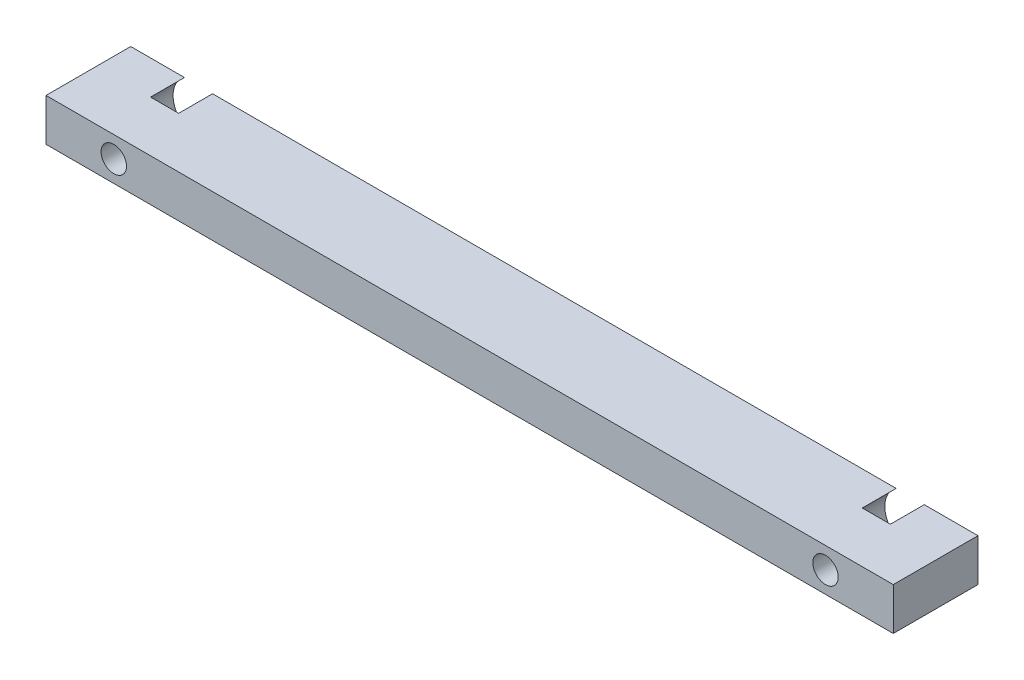
ISO-10303-21;
HEADER;
FILE_DESCRIPTION(('STEP AP214'),'2;1');
FILE_NAME('part.step','',(''),(''),'','','');
FILE_SCHEMA(('AUTOMOTIVE_DESIGN { 1 0 10303 214 1 1 1 1 }'));
ENDSEC;
DATA;
#1=APPLICATION_CONTEXT('core data for automotive mechanical design processes');
#2=APPLICATION_PROTOCOL_DEFINITION('international standard','automotive_design',2000,#1);
#3=PRODUCT_CONTEXT('',#1,'mechanical');
#4=PRODUCT('Part','Part','',(#3));
#5=PRODUCT_RELATED_PRODUCT_CATEGORY('part','',(#4));
#6=PRODUCT_DEFINITION_FORMATION('','',#4);
#7=PRODUCT_DEFINITION_CONTEXT('part definition',#1,'design');
#8=PRODUCT_DEFINITION('design','',#6,#7);
#9=PRODUCT_DEFINITION_SHAPE('','',#8);
#10=(LENGTH_UNIT() NAMED_UNIT(*) SI_UNIT(.MILLI.,.METRE.));
#11=(NAMED_UNIT(*) PLANE_ANGLE_UNIT() SI_UNIT($,.RADIAN.));
#12=(NAMED_UNIT(*) SI_UNIT($,.STERADIAN.) SOLID_ANGLE_UNIT());
#13=UNCERTAINTY_MEASURE_WITH_UNIT(LENGTH_MEASURE(1.E-05),#10,'distance_accuracy_value','');
#14=(GEOMETRIC_REPRESENTATION_CONTEXT(3) GLOBAL_UNCERTAINTY_ASSIGNED_CONTEXT((#13)) GLOBAL_UNIT_ASSIGNED_CONTEXT((#10,
#11,#12)) REPRESENTATION_CONTEXT('',''));
#15=CARTESIAN_POINT('',(0.,0.,0.));
#16=DIRECTION('',(0.,0.,1.));
#17=DIRECTION('',(1.,0.,0.));
#18=AXIS2_PLACEMENT_3D('',#15,#16,#17);
#19=CARTESIAN_POINT('',(0.,0.,0.));
#20=DIRECTION('',(0.,0.,-1.));
#21=DIRECTION('',(-1.,0.,0.));
#22=AXIS2_PLACEMENT_3D('',#19,#20,#21);
#23=PLANE('',#22);
#24=CARTESIAN_POINT('',(42.,0.,0.));
#25=DIRECTION('',(0.,0.,-1.));
#26=DIRECTION('',(-1.,0.,0.));
#27=AXIS2_PLACEMENT_3D('',#24,#25,#26);
#28=CIRCLE('',#27,3.);
#29=CARTESIAN_POINT('',(43.6583123951777,2.50000000000001,0.));
#30=VERTEX_POINT('',#29);
#31=CARTESIAN_POINT('',(43.6583123951777,-2.49999999999999,0.));
#32=VERTEX_POINT('',#31);
#33=EDGE_CURVE('E223',#30,#32,#28,.T.);
#34=ORIENTED_EDGE('',*,*,#33,.F.);
#35=DIRECTION('',(-1.,0.,0.));
#36=VECTOR('',#35,1.);
#37=CARTESIAN_POINT('',(50.,2.50000000000001,0.));
#38=LINE('',#37,#36);
#39=CARTESIAN_POINT('',(50.,2.50000000000001,0.));
#40=VERTEX_POINT('',#39);
#41=EDGE_CURVE('E177',#40,#30,#38,.T.);
#42=ORIENTED_EDGE('',*,*,#41,.F.);
#43=DIRECTION('',(0.,1.,0.));
#44=VECTOR('',#43,1.);
#45=CARTESIAN_POINT('',(50.,2.50000000000001,0.));
#46=LINE('',#45,#44);
#47=CARTESIAN_POINT('',(50.,-2.49999999999999,0.));
#48=VERTEX_POINT('',#47);
#49=EDGE_CURVE('E194',#48,#40,#46,.T.);
#50=ORIENTED_EDGE('',*,*,#49,.F.);
#51=DIRECTION('',(1.,0.,0.));
#52=VECTOR('',#51,1.);
#53=CARTESIAN_POINT('',(50.,-2.49999999999999,0.));
#54=LINE('',#53,#52);
#55=EDGE_CURVE('E190',#32,#48,#54,.T.);
#56=ORIENTED_EDGE('',*,*,#55,.F.);
#57=EDGE_LOOP('',(#34,#42,#50,#56));
#58=FACE_BOUND('',#57,.T.);
#59=ADVANCED_FACE('F43',(#58),#23,.T.);
#60=CARTESIAN_POINT('',(40.3416876048223,-2.49999999999999,0.));
#61=VERTEX_POINT('',#60);
#62=CARTESIAN_POINT('',(40.3416876048223,2.50000000000001,0.));
#63=VERTEX_POINT('',#62);
#64=EDGE_CURVE('E221',#61,#63,#28,.T.);
#65=ORIENTED_EDGE('',*,*,#64,.F.);
#66=CARTESIAN_POINT('',(-40.3416876048223,-2.5,0.));
#67=VERTEX_POINT('',#66);
#68=EDGE_CURVE('E195',#67,#61,#54,.T.);
#69=ORIENTED_EDGE('',*,*,#68,.F.);
#70=CARTESIAN_POINT('',(-42.,0.,0.));
#71=DIRECTION('',(0.,0.,-1.));
#72=DIRECTION('',(-1.,0.,0.));
#73=AXIS2_PLACEMENT_3D('',#70,#71,#72);
#74=CIRCLE('',#73,3.);
#75=CARTESIAN_POINT('',(-40.3416876048223,2.49999999999999,0.));
#76=VERTEX_POINT('',#75);
#77=EDGE_CURVE('E140',#76,#67,#74,.T.);
#78=ORIENTED_EDGE('',*,*,#77,.F.);
#79=EDGE_CURVE('E202',#63,#76,#38,.T.);
#80=ORIENTED_EDGE('',*,*,#79,.F.);
#81=EDGE_LOOP('',(#65,#69,#78,#80));
#82=FACE_BOUND('',#81,.T.);
#83=ADVANCED_FACE('F242',(#82),#23,.T.);
#84=CARTESIAN_POINT('',(-50.,2.49999999999999,10.));
#85=DIRECTION('',(1.,0.,0.));
#86=DIRECTION('',(0.,0.,-1.));
#87=AXIS2_PLACEMENT_3D('',#84,#85,#86);
#88=PLANE('',#87);
#89=DIRECTION('',(0.,-1.,0.));
#90=VECTOR('',#89,1.);
#91=CARTESIAN_POINT('',(-50.,2.49999999999999,0.));
#92=LINE('',#91,#90);
#93=CARTESIAN_POINT('',(-50.,2.49999999999999,0.));
#94=VERTEX_POINT('',#93);
#95=CARTESIAN_POINT('',(-50.,-2.50000000000001,0.));
#96=VERTEX_POINT('',#95);
#97=EDGE_CURVE('E166',#94,#96,#92,.T.);
#98=ORIENTED_EDGE('',*,*,#97,.T.);
#99=DIRECTION('',(0.,0.,-1.));
#100=VECTOR('',#99,1.);
#101=CARTESIAN_POINT('',(-50.,-2.50000000000001,10.));
#102=LINE('',#101,#100);
#103=CARTESIAN_POINT('',(-50.,-2.50000000000001,10.));
#104=VERTEX_POINT('',#103);
#105=EDGE_CURVE('E214',#104,#96,#102,.T.);
#106=ORIENTED_EDGE('',*,*,#105,.F.);
#107=DIRECTION('',(0.,-1.,0.));
#108=VECTOR('',#107,1.);
#109=CARTESIAN_POINT('',(-50.,2.49999999999999,10.));
#110=LINE('',#109,#108);
#111=CARTESIAN_POINT('',(-50.,2.49999999999999,10.));
#112=VERTEX_POINT('',#111);
#113=EDGE_CURVE('E172',#112,#104,#110,.T.);
#114=ORIENTED_EDGE('',*,*,#113,.F.);
#115=DIRECTION('',(0.,0.,-1.));
#116=VECTOR('',#115,1.);
#117=CARTESIAN_POINT('',(-50.,2.49999999999999,10.));
#118=LINE('',#117,#116);
#119=EDGE_CURVE('E186',#112,#94,#118,.T.);
#120=ORIENTED_EDGE('',*,*,#119,.T.);
#121=EDGE_LOOP('',(#98,#106,#114,#120));
#122=FACE_BOUND('',#121,.T.);
#123=ADVANCED_FACE('F45',(#122),#88,.F.);
#124=CARTESIAN_POINT('',(50.,-2.49999999999999,10.));
#125=DIRECTION('',(0.,1.,0.));
#126=DIRECTION('',(-1.,0.,0.));
#127=AXIS2_PLACEMENT_3D('',#124,#125,#126);
#128=PLANE('',#127);
#129=DIRECTION('',(-1.,0.,0.));
#130=VECTOR('',#129,1.);
#131=CARTESIAN_POINT('',(50.,-2.49999999999999,4.));
#132=LINE('',#131,#130);
#133=CARTESIAN_POINT('',(43.6583123951777,-2.49999999999999,4.));
#134=VERTEX_POINT('',#133);
#135=CARTESIAN_POINT('',(40.3416876048223,-2.49999999999999,4.));
#136=VERTEX_POINT('',#135);
#137=EDGE_CURVE('E161',#134,#136,#132,.T.);
#138=ORIENTED_EDGE('',*,*,#137,.F.);
#139=DIRECTION('',(0.,0.,-1.));
#140=VECTOR('',#139,1.);
#141=CARTESIAN_POINT('',(43.6583123951777,-2.49999999999999,4.));
#142=LINE('',#141,#140);
#143=EDGE_CURVE('E162',#134,#32,#142,.T.);
#144=ORIENTED_EDGE('',*,*,#143,.T.);
#145=ORIENTED_EDGE('',*,*,#55,.T.);
#146=DIRECTION('',(0.,0.,-1.));
#147=VECTOR('',#146,1.);
#148=CARTESIAN_POINT('',(50.,-2.49999999999999,10.));
#149=LINE('',#148,#147);
#150=CARTESIAN_POINT('',(50.,-2.49999999999999,10.));
#151=VERTEX_POINT('',#150);
#152=EDGE_CURVE('E210',#151,#48,#149,.T.);
#153=ORIENTED_EDGE('',*,*,#152,.F.);
#154=DIRECTION('',(1.,0.,0.));
#155=VECTOR('',#154,1.);
#156=CARTESIAN_POINT('',(50.,-2.49999999999999,10.));
#157=LINE('',#156,#155);
#158=EDGE_CURVE('E176',#104,#151,#157,.T.);
#159=ORIENTED_EDGE('',*,*,#158,.F.);
#160=ORIENTED_EDGE('',*,*,#105,.T.);
#161=CARTESIAN_POINT('',(-43.6583123951777,-2.5,0.));
#162=VERTEX_POINT('',#161);
#163=EDGE_CURVE('E191',#96,#162,#54,.T.);
#164=ORIENTED_EDGE('',*,*,#163,.T.);
#165=DIRECTION('',(0.,0.,-1.));
#166=VECTOR('',#165,1.);
#167=CARTESIAN_POINT('',(-43.6583123951777,-2.5,4.));
#168=LINE('',#167,#166);
#169=CARTESIAN_POINT('',(-43.6583123951777,-2.5,4.));
#170=VERTEX_POINT('',#169);
#171=EDGE_CURVE('E67',#162,#170,#168,.F.);
#172=ORIENTED_EDGE('',*,*,#171,.T.);
#173=DIRECTION('',(1.,0.,0.));
#174=VECTOR('',#173,1.);
#175=CARTESIAN_POINT('',(50.,-2.49999999999999,4.));
#176=LINE('',#175,#174);
#177=CARTESIAN_POINT('',(-40.3416876048223,-2.5,4.));
#178=VERTEX_POINT('',#177);
#179=EDGE_CURVE('E151',#170,#178,#176,.T.);
#180=ORIENTED_EDGE('',*,*,#179,.T.);
#181=DIRECTION('',(0.,0.,-1.));
#182=VECTOR('',#181,1.);
#183=CARTESIAN_POINT('',(-40.3416876048223,-2.5,4.));
#184=LINE('',#183,#182);
#185=EDGE_CURVE('E134',#178,#67,#184,.T.);
#186=ORIENTED_EDGE('',*,*,#185,.T.);
#187=ORIENTED_EDGE('',*,*,#68,.T.);
#188=DIRECTION('',(0.,0.,-1.));
#189=VECTOR('',#188,1.);
#190=CARTESIAN_POINT('',(40.3416876048223,-2.49999999999999,4.));
#191=LINE('',#190,#189);
#192=EDGE_CURVE('E59',#61,#136,#191,.F.);
#193=ORIENTED_EDGE('',*,*,#192,.T.);
#194=EDGE_LOOP('',(#138,#144,#145,#153,#159,#160,#164,#172,#180,#186,#187,#193));
#195=FACE_BOUND('',#194,.T.);
#196=ADVANCED_FACE('F158',(#195),#128,.F.);
#197=CARTESIAN_POINT('',(50.,2.50000000000001,10.));
#198=DIRECTION('',(-1.,0.,0.));
#199=DIRECTION('',(0.,0.,1.));
#200=AXIS2_PLACEMENT_3D('',#197,#198,#199);
#201=PLANE('',#200);
#202=ORIENTED_EDGE('',*,*,#49,.T.);
#203=DIRECTION('',(0.,0.,-1.));
#204=VECTOR('',#203,1.);
#205=CARTESIAN_POINT('',(50.,2.50000000000001,10.));
#206=LINE('',#205,#204);
#207=CARTESIAN_POINT('',(50.,2.50000000000001,10.));
#208=VERTEX_POINT('',#207);
#209=EDGE_CURVE('E206',#208,#40,#206,.T.);
#210=ORIENTED_EDGE('',*,*,#209,.F.);
#211=DIRECTION('',(0.,1.,0.));
#212=VECTOR('',#211,1.);
#213=CARTESIAN_POINT('',(50.,2.50000000000001,10.));
#214=LINE('',#213,#212);
#215=EDGE_CURVE('E180',#151,#208,#214,.T.);
#216=ORIENTED_EDGE('',*,*,#215,.F.);
#217=ORIENTED_EDGE('',*,*,#152,.T.);
#218=EDGE_LOOP('',(#202,#210,#216,#217));
#219=FACE_BOUND('',#218,.T.);
#220=ADVANCED_FACE('F318',(#219),#201,.F.);
#221=CARTESIAN_POINT('',(50.,2.50000000000001,10.));
#222=DIRECTION('',(0.,-1.,0.));
#223=DIRECTION('',(1.,0.,0.));
#224=AXIS2_PLACEMENT_3D('',#221,#222,#223);
#225=PLANE('',#224);
#226=DIRECTION('',(1.,0.,0.));
#227=VECTOR('',#226,1.);
#228=CARTESIAN_POINT('',(50.,2.50000000000001,4.));
#229=LINE('',#228,#227);
#230=CARTESIAN_POINT('',(40.3416876048223,2.50000000000001,4.));
#231=VERTEX_POINT('',#230);
#232=CARTESIAN_POINT('',(43.6583123951777,2.50000000000001,4.));
#233=VERTEX_POINT('',#232);
#234=EDGE_CURVE('E11',#231,#233,#229,.T.);
#235=ORIENTED_EDGE('',*,*,#234,.F.);
#236=DIRECTION('',(0.,0.,-1.));
#237=VECTOR('',#236,1.);
#238=CARTESIAN_POINT('',(40.3416876048223,2.50000000000001,4.));
#239=LINE('',#238,#237);
#240=EDGE_CURVE('E247',#231,#63,#239,.T.);
#241=ORIENTED_EDGE('',*,*,#240,.T.);
#242=ORIENTED_EDGE('',*,*,#79,.T.);
#243=DIRECTION('',(0.,0.,-1.));
#244=VECTOR('',#243,1.);
#245=CARTESIAN_POINT('',(-40.3416876048223,2.5,4.));
#246=LINE('',#245,#244);
#247=CARTESIAN_POINT('',(-40.3416876048223,2.5,4.));
#248=VERTEX_POINT('',#247);
#249=EDGE_CURVE('E262',#76,#248,#246,.F.);
#250=ORIENTED_EDGE('',*,*,#249,.T.);
#251=DIRECTION('',(-1.,0.,0.));
#252=VECTOR('',#251,1.);
#253=CARTESIAN_POINT('',(50.,2.50000000000001,4.));
#254=LINE('',#253,#252);
#255=CARTESIAN_POINT('',(-43.6583123951777,2.5,4.));
#256=VERTEX_POINT('',#255);
#257=EDGE_CURVE('E52',#248,#256,#254,.T.);
#258=ORIENTED_EDGE('',*,*,#257,.T.);
#259=DIRECTION('',(0.,0.,-1.));
#260=VECTOR('',#259,1.);
#261=CARTESIAN_POINT('',(-43.6583123951777,2.5,4.));
#262=LINE('',#261,#260);
#263=CARTESIAN_POINT('',(-43.6583123951777,2.49999999999999,0.));
#264=VERTEX_POINT('',#263);
#265=EDGE_CURVE('E259',#256,#264,#262,.T.);
#266=ORIENTED_EDGE('',*,*,#265,.T.);
#267=EDGE_CURVE('E198',#264,#94,#38,.T.);
#268=ORIENTED_EDGE('',*,*,#267,.T.);
#269=ORIENTED_EDGE('',*,*,#119,.F.);
#270=DIRECTION('',(-1.,0.,0.));
#271=VECTOR('',#270,1.);
#272=CARTESIAN_POINT('',(50.,2.50000000000001,10.));
#273=LINE('',#272,#271);
#274=EDGE_CURVE('E183',#208,#112,#273,.T.);
#275=ORIENTED_EDGE('',*,*,#274,.F.);
#276=ORIENTED_EDGE('',*,*,#209,.T.);
#277=ORIENTED_EDGE('',*,*,#41,.T.);
#278=DIRECTION('',(0.,0.,-1.));
#279=VECTOR('',#278,1.);
#280=CARTESIAN_POINT('',(43.6583123951777,2.50000000000001,4.));
#281=LINE('',#280,#279);
#282=EDGE_CURVE('E146',#30,#233,#281,.F.);
#283=ORIENTED_EDGE('',*,*,#282,.T.);
#284=EDGE_LOOP('',(#235,#241,#242,#250,#258,#266,#268,#269,#275,#276,#277,#283));
#285=FACE_BOUND('',#284,.T.);
#286=ADVANCED_FACE('F250',(#285),#225,.F.);
#287=CARTESIAN_POINT('',(0.,0.,10.));
#288=DIRECTION('',(0.,0.,-1.));
#289=DIRECTION('',(-1.,0.,0.));
#290=AXIS2_PLACEMENT_3D('',#287,#288,#289);
#291=PLANE('',#290);
#292=CARTESIAN_POINT('',(42.,0.,10.));
#293=DIRECTION('',(0.,0.,-1.));
#294=DIRECTION('',(-1.,0.,0.));
#295=AXIS2_PLACEMENT_3D('',#292,#293,#294);
#296=CIRCLE('',#295,1.5);
#297=CARTESIAN_POINT('',(40.5,0.,10.));
#298=VERTEX_POINT('',#297);
#299=EDGE_CURVE('E155',#298,#298,#296,.T.);
#300=ORIENTED_EDGE('',*,*,#299,.T.);
#301=EDGE_LOOP('',(#300));
#302=FACE_BOUND('',#301,.T.);
#303=CARTESIAN_POINT('',(-42.,0.,10.));
#304=DIRECTION('',(0.,0.,-1.));
#305=DIRECTION('',(1.,0.,0.));
#306=AXIS2_PLACEMENT_3D('',#303,#304,#305);
#307=CIRCLE('',#306,1.5);
#308=CARTESIAN_POINT('',(-40.5,0.,10.));
#309=VERTEX_POINT('',#308);
#310=EDGE_CURVE('E269',#309,#309,#307,.T.);
#311=ORIENTED_EDGE('',*,*,#310,.T.);
#312=EDGE_LOOP('',(#311));
#313=FACE_BOUND('',#312,.T.);
#314=ORIENTED_EDGE('',*,*,#113,.T.);
#315=ORIENTED_EDGE('',*,*,#158,.T.);
#316=ORIENTED_EDGE('',*,*,#215,.T.);
#317=ORIENTED_EDGE('',*,*,#274,.T.);
#318=EDGE_LOOP('',(#314,#315,#316,#317));
#319=FACE_BOUND('',#318,.T.);
#320=ADVANCED_FACE('F285',(#302,#313,#319),#291,.F.);
#321=EDGE_CURVE('E218',#162,#264,#74,.T.);
#322=ORIENTED_EDGE('',*,*,#321,.F.);
#323=ORIENTED_EDGE('',*,*,#163,.F.);
#324=ORIENTED_EDGE('',*,*,#97,.F.);
#325=ORIENTED_EDGE('',*,*,#267,.F.);
#326=EDGE_LOOP('',(#322,#323,#324,#325));
#327=FACE_BOUND('',#326,.T.);
#328=ADVANCED_FACE('F306',(#327),#23,.T.);
#329=CARTESIAN_POINT('',(-42.,0.,4.));
#330=DIRECTION('',(0.,0.,1.));
#331=DIRECTION('',(1.,0.,0.));
#332=AXIS2_PLACEMENT_3D('',#329,#330,#331);
#333=PLANE('',#332);
#334=CARTESIAN_POINT('',(-42.,0.,4.));
#335=DIRECTION('',(0.,0.,-1.));
#336=DIRECTION('',(1.,0.,0.));
#337=AXIS2_PLACEMENT_3D('',#334,#335,#336);
#338=CIRCLE('',#337,1.5);
#339=CARTESIAN_POINT('',(-40.5,0.,4.));
#340=VERTEX_POINT('',#339);
#341=EDGE_CURVE('E273',#340,#340,#338,.T.);
#342=ORIENTED_EDGE('',*,*,#341,.F.);
#343=EDGE_LOOP('',(#342));
#344=FACE_BOUND('',#343,.T.);
#345=CARTESIAN_POINT('',(-42.,0.,4.));
#346=DIRECTION('',(0.,0.,-1.));
#347=DIRECTION('',(1.,0.,0.));
#348=AXIS2_PLACEMENT_3D('',#345,#346,#347);
#349=CIRCLE('',#348,3.);
#350=EDGE_CURVE('E154',#170,#256,#349,.T.);
#351=ORIENTED_EDGE('',*,*,#350,.T.);
#352=ORIENTED_EDGE('',*,*,#257,.F.);
#353=EDGE_CURVE('E137',#248,#178,#349,.T.);
#354=ORIENTED_EDGE('',*,*,#353,.T.);
#355=ORIENTED_EDGE('',*,*,#179,.F.);
#356=EDGE_LOOP('',(#351,#352,#354,#355));
#357=FACE_BOUND('',#356,.T.);
#358=ADVANCED_FACE('F150',(#344,#357),#333,.F.);
#359=CARTESIAN_POINT('',(-42.,0.,4.));
#360=DIRECTION('',(0.,0.,-1.));
#361=DIRECTION('',(-1.,0.,0.));
#362=AXIS2_PLACEMENT_3D('',#359,#360,#361);
#363=CYLINDRICAL_SURFACE('',#362,3.);
#364=ORIENTED_EDGE('',*,*,#353,.F.);
#365=ORIENTED_EDGE('',*,*,#249,.F.);
#366=ORIENTED_EDGE('',*,*,#77,.T.);
#367=ORIENTED_EDGE('',*,*,#185,.F.);
#368=EDGE_LOOP('',(#364,#365,#366,#367));
#369=FACE_BOUND('',#368,.T.);
#370=ADVANCED_FACE('F136',(#369),#363,.F.);
#371=ORIENTED_EDGE('',*,*,#321,.T.);
#372=ORIENTED_EDGE('',*,*,#265,.F.);
#373=ORIENTED_EDGE('',*,*,#350,.F.);
#374=ORIENTED_EDGE('',*,*,#171,.F.);
#375=EDGE_LOOP('',(#371,#372,#373,#374));
#376=FACE_BOUND('',#375,.T.);
#377=ADVANCED_FACE('F298',(#376),#363,.F.);
#378=CARTESIAN_POINT('',(42.,0.,4.));
#379=DIRECTION('',(0.,0.,-1.));
#380=DIRECTION('',(-1.,0.,0.));
#381=AXIS2_PLACEMENT_3D('',#378,#379,#380);
#382=PLANE('',#381);
#383=CARTESIAN_POINT('',(42.,0.,4.));
#384=DIRECTION('',(0.,0.,-1.));
#385=DIRECTION('',(-1.,0.,0.));
#386=AXIS2_PLACEMENT_3D('',#383,#384,#385);
#387=CIRCLE('',#386,1.5);
#388=CARTESIAN_POINT('',(40.5,0.,4.));
#389=VERTEX_POINT('',#388);
#390=EDGE_CURVE('E277',#389,#389,#387,.T.);
#391=ORIENTED_EDGE('',*,*,#390,.F.);
#392=EDGE_LOOP('',(#391));
#393=FACE_BOUND('',#392,.T.);
#394=ORIENTED_EDGE('',*,*,#137,.T.);
#395=CARTESIAN_POINT('',(42.,0.,4.));
#396=DIRECTION('',(0.,0.,-1.));
#397=DIRECTION('',(-1.,0.,0.));
#398=AXIS2_PLACEMENT_3D('',#395,#396,#397);
#399=CIRCLE('',#398,3.);
#400=EDGE_CURVE('E266',#136,#231,#399,.T.);
#401=ORIENTED_EDGE('',*,*,#400,.T.);
#402=ORIENTED_EDGE('',*,*,#234,.T.);
#403=EDGE_CURVE('E264',#233,#134,#399,.T.);
#404=ORIENTED_EDGE('',*,*,#403,.T.);
#405=EDGE_LOOP('',(#394,#401,#402,#404));
#406=FACE_BOUND('',#405,.T.);
#407=ADVANCED_FACE('F295',(#393,#406),#382,.T.);
#408=CARTESIAN_POINT('',(42.,0.,4.));
#409=DIRECTION('',(0.,0.,-1.));
#410=DIRECTION('',(-1.,0.,0.));
#411=AXIS2_PLACEMENT_3D('',#408,#409,#410);
#412=CYLINDRICAL_SURFACE('',#411,3.);
#413=ORIENTED_EDGE('',*,*,#403,.F.);
#414=ORIENTED_EDGE('',*,*,#282,.F.);
#415=ORIENTED_EDGE('',*,*,#33,.T.);
#416=ORIENTED_EDGE('',*,*,#143,.F.);
#417=EDGE_LOOP('',(#413,#414,#415,#416));
#418=FACE_BOUND('',#417,.T.);
#419=ADVANCED_FACE('F231',(#418),#412,.F.);
#420=ORIENTED_EDGE('',*,*,#64,.T.);
#421=ORIENTED_EDGE('',*,*,#240,.F.);
#422=ORIENTED_EDGE('',*,*,#400,.F.);
#423=ORIENTED_EDGE('',*,*,#192,.F.);
#424=EDGE_LOOP('',(#420,#421,#422,#423));
#425=FACE_BOUND('',#424,.T.);
#426=ADVANCED_FACE('F246',(#425),#412,.F.);
#427=CARTESIAN_POINT('',(42.,0.,10.));
#428=DIRECTION('',(0.,0.,-1.));
#429=DIRECTION('',(-1.,0.,0.));
#430=AXIS2_PLACEMENT_3D('',#427,#428,#429);
#431=CYLINDRICAL_SURFACE('',#430,1.5);
#432=ORIENTED_EDGE('',*,*,#299,.F.);
#433=EDGE_LOOP('',(#432));
#434=FACE_BOUND('',#433,.T.);
#435=ORIENTED_EDGE('',*,*,#390,.T.);
#436=EDGE_LOOP('',(#435));
#437=FACE_BOUND('',#436,.T.);
#438=ADVANCED_FACE('F288',(#434,#437),#431,.F.);
#439=CARTESIAN_POINT('',(-42.,0.,10.));
#440=DIRECTION('',(0.,0.,-1.));
#441=DIRECTION('',(-1.,0.,0.));
#442=AXIS2_PLACEMENT_3D('',#439,#440,#441);
#443=CYLINDRICAL_SURFACE('',#442,1.5);
#444=ORIENTED_EDGE('',*,*,#310,.F.);
#445=EDGE_LOOP('',(#444));
#446=FACE_BOUND('',#445,.T.);
#447=ORIENTED_EDGE('',*,*,#341,.T.);
#448=EDGE_LOOP('',(#447));
#449=FACE_BOUND('',#448,.T.);
#450=ADVANCED_FACE('F291',(#446,#449),#443,.F.);
#451=CLOSED_SHELL('',(#59,#83,#123,#196,#220,#286,#320,#328,#358,#370,#377,#407,#419,#426,#438,#450));
#452=MANIFOLD_SOLID_BREP('B2',#451);
#453=ADVANCED_BREP_SHAPE_REPRESENTATION('',(#18,#452),#14);
#454=SHAPE_DEFINITION_REPRESENTATION(#9,#453);
ENDSEC;
END-ISO-10303-21;
